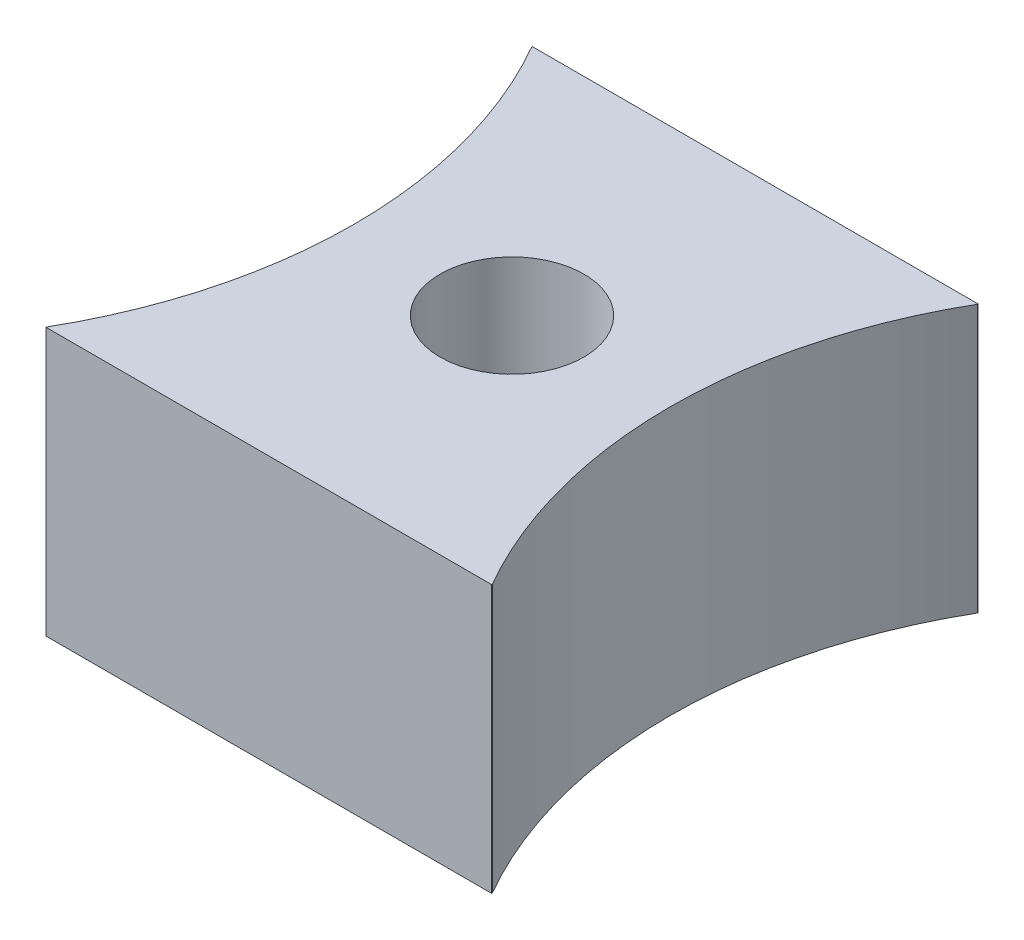
ISO-10303-21;
HEADER;
FILE_DESCRIPTION(('STEP AP214'),'2;1');
FILE_NAME('part.step','',(''),(''),'','','');
FILE_SCHEMA(('AUTOMOTIVE_DESIGN { 1 0 10303 214 1 1 1 1 }'));
ENDSEC;
DATA;
#1=APPLICATION_CONTEXT('core data for automotive mechanical design processes');
#2=APPLICATION_PROTOCOL_DEFINITION('international standard','automotive_design',2000,#1);
#3=PRODUCT_CONTEXT('',#1,'mechanical');
#4=PRODUCT('Part','Part','',(#3));
#5=PRODUCT_RELATED_PRODUCT_CATEGORY('part','',(#4));
#6=PRODUCT_DEFINITION_FORMATION('','',#4);
#7=PRODUCT_DEFINITION_CONTEXT('part definition',#1,'design');
#8=PRODUCT_DEFINITION('design','',#6,#7);
#9=PRODUCT_DEFINITION_SHAPE('','',#8);
#10=(LENGTH_UNIT() NAMED_UNIT(*) SI_UNIT(.MILLI.,.METRE.));
#11=(NAMED_UNIT(*) PLANE_ANGLE_UNIT() SI_UNIT($,.RADIAN.));
#12=(NAMED_UNIT(*) SI_UNIT($,.STERADIAN.) SOLID_ANGLE_UNIT());
#13=UNCERTAINTY_MEASURE_WITH_UNIT(LENGTH_MEASURE(1.E-05),#10,'distance_accuracy_value','');
#14=(GEOMETRIC_REPRESENTATION_CONTEXT(3) GLOBAL_UNCERTAINTY_ASSIGNED_CONTEXT((#13)) GLOBAL_UNIT_ASSIGNED_CONTEXT((#10,
#11,#12)) REPRESENTATION_CONTEXT('',''));
#15=CARTESIAN_POINT('',(0.,0.,0.));
#16=DIRECTION('',(0.,0.,1.));
#17=DIRECTION('',(1.,0.,0.));
#18=AXIS2_PLACEMENT_3D('',#15,#16,#17);
#19=CARTESIAN_POINT('',(0.,6.6,0.));
#20=DIRECTION('',(1.,0.,0.));
#21=DIRECTION('',(0.,0.,-1.));
#22=AXIS2_PLACEMENT_3D('',#19,#20,#21);
#23=PLANE('',#22);
#24=DIRECTION('',(0.,0.,1.));
#25=VECTOR('',#24,1.);
#26=CARTESIAN_POINT('',(0.,0.,0.));
#27=LINE('',#26,#25);
#28=CARTESIAN_POINT('',(0.,0.,0.));
#29=VERTEX_POINT('',#28);
#30=CARTESIAN_POINT('',(0.,0.,0.013348181161687));
#31=VERTEX_POINT('',#30);
#32=EDGE_CURVE('E140',#29,#31,#27,.T.);
#33=ORIENTED_EDGE('',*,*,#32,.T.);
#34=DIRECTION('',(0.,1.,0.));
#35=VECTOR('',#34,1.);
#36=CARTESIAN_POINT('',(0.,0.,0.013348181161687));
#37=LINE('',#36,#35);
#38=CARTESIAN_POINT('',(0.,6.6,0.013348181161687));
#39=VERTEX_POINT('',#38);
#40=EDGE_CURVE('E69',#31,#39,#37,.T.);
#41=ORIENTED_EDGE('',*,*,#40,.T.);
#42=DIRECTION('',(0.,0.,1.));
#43=VECTOR('',#42,1.);
#44=CARTESIAN_POINT('',(0.,6.6,0.));
#45=LINE('',#44,#43);
#46=CARTESIAN_POINT('',(0.,6.6,0.));
#47=VERTEX_POINT('',#46);
#48=EDGE_CURVE('E183',#47,#39,#45,.T.);
#49=ORIENTED_EDGE('',*,*,#48,.F.);
#50=DIRECTION('',(0.,-1.,0.));
#51=VECTOR('',#50,1.);
#52=CARTESIAN_POINT('',(0.,6.6,0.));
#53=LINE('',#52,#51);
#54=EDGE_CURVE('E147',#47,#29,#53,.T.);
#55=ORIENTED_EDGE('',*,*,#54,.T.);
#56=EDGE_LOOP('',(#33,#41,#49,#55));
#57=FACE_BOUND('',#56,.T.);
#58=ADVANCED_FACE('F45',(#57),#23,.F.);
#59=CARTESIAN_POINT('',(11.,6.6,0.));
#60=DIRECTION('',(-1.,0.,0.));
#61=DIRECTION('',(0.,0.,1.));
#62=AXIS2_PLACEMENT_3D('',#59,#60,#61);
#63=PLANE('',#62);
#64=DIRECTION('',(0.,1.,0.));
#65=VECTOR('',#64,1.);
#66=CARTESIAN_POINT('',(11.,0.,11.9866518188383));
#67=LINE('',#66,#65);
#68=CARTESIAN_POINT('',(11.,0.,11.9866518188383));
#69=VERTEX_POINT('',#68);
#70=CARTESIAN_POINT('',(11.,6.6,11.9866518188383));
#71=VERTEX_POINT('',#70);
#72=EDGE_CURVE('E61',#69,#71,#67,.T.);
#73=ORIENTED_EDGE('',*,*,#72,.T.);
#74=DIRECTION('',(0.,0.,-1.));
#75=VECTOR('',#74,1.);
#76=CARTESIAN_POINT('',(11.,6.6,0.));
#77=LINE('',#76,#75);
#78=CARTESIAN_POINT('',(11.,6.6,12.));
#79=VERTEX_POINT('',#78);
#80=EDGE_CURVE('E161',#79,#71,#77,.T.);
#81=ORIENTED_EDGE('',*,*,#80,.F.);
#82=DIRECTION('',(0.,-1.,0.));
#83=VECTOR('',#82,1.);
#84=CARTESIAN_POINT('',(11.,6.6,12.));
#85=LINE('',#84,#83);
#86=CARTESIAN_POINT('',(11.,0.,12.));
#87=VERTEX_POINT('',#86);
#88=EDGE_CURVE('E54',#79,#87,#85,.T.);
#89=ORIENTED_EDGE('',*,*,#88,.T.);
#90=DIRECTION('',(0.,0.,-1.));
#91=VECTOR('',#90,1.);
#92=CARTESIAN_POINT('',(11.,0.,0.));
#93=LINE('',#92,#91);
#94=EDGE_CURVE('E135',#87,#69,#93,.T.);
#95=ORIENTED_EDGE('',*,*,#94,.T.);
#96=EDGE_LOOP('',(#73,#81,#89,#95));
#97=FACE_BOUND('',#96,.T.);
#98=ADVANCED_FACE('F159',(#97),#63,.F.);
#99=DIRECTION('',(0.,1.,0.));
#100=VECTOR('',#99,1.);
#101=CARTESIAN_POINT('',(11.,0.,0.0133481811616879));
#102=LINE('',#101,#100);
#103=CARTESIAN_POINT('',(11.,0.,0.0133481811616879));
#104=VERTEX_POINT('',#103);
#105=CARTESIAN_POINT('',(11.,6.6,0.0133481811616879));
#106=VERTEX_POINT('',#105);
#107=EDGE_CURVE('E111',#104,#106,#102,.T.);
#108=ORIENTED_EDGE('',*,*,#107,.F.);
#109=CARTESIAN_POINT('',(11.,0.,0.));
#110=VERTEX_POINT('',#109);
#111=EDGE_CURVE('E124',#104,#110,#93,.T.);
#112=ORIENTED_EDGE('',*,*,#111,.T.);
#113=DIRECTION('',(0.,-1.,0.));
#114=VECTOR('',#113,1.);
#115=CARTESIAN_POINT('',(11.,6.6,0.));
#116=LINE('',#115,#114);
#117=CARTESIAN_POINT('',(11.,6.6,0.));
#118=VERTEX_POINT('',#117);
#119=EDGE_CURVE('E151',#118,#110,#116,.T.);
#120=ORIENTED_EDGE('',*,*,#119,.F.);
#121=EDGE_CURVE('E126',#106,#118,#77,.T.);
#122=ORIENTED_EDGE('',*,*,#121,.F.);
#123=EDGE_LOOP('',(#108,#112,#120,#122));
#124=FACE_BOUND('',#123,.T.);
#125=ADVANCED_FACE('F122',(#124),#63,.F.);
#126=CARTESIAN_POINT('',(0.,6.6,0.));
#127=DIRECTION('',(0.,1.,0.));
#128=DIRECTION('',(0.,0.,1.));
#129=AXIS2_PLACEMENT_3D('',#126,#127,#128);
#130=PLANE('',#129);
#131=CARTESIAN_POINT('',(5.5,6.6,6.));
#132=DIRECTION('',(0.,1.,0.));
#133=DIRECTION('',(0.,0.,1.));
#134=AXIS2_PLACEMENT_3D('',#131,#132,#133);
#135=CIRCLE('',#134,1.775);
#136=CARTESIAN_POINT('',(5.5,6.6,7.775));
#137=VERTEX_POINT('',#136);
#138=EDGE_CURVE('E187',#137,#137,#135,.T.);
#139=ORIENTED_EDGE('',*,*,#138,.F.);
#140=EDGE_LOOP('',(#139));
#141=FACE_BOUND('',#140,.T.);
#142=ORIENTED_EDGE('',*,*,#80,.T.);
#143=CARTESIAN_POINT('',(21.4,6.6,5.99999999999999));
#144=DIRECTION('',(0.,1.,0.));
#145=DIRECTION('',(0.,0.,1.));
#146=AXIS2_PLACEMENT_3D('',#143,#144,#145);
#147=CIRCLE('',#146,12.);
#148=EDGE_CURVE('E118',#71,#106,#147,.F.);
#149=ORIENTED_EDGE('',*,*,#148,.T.);
#150=ORIENTED_EDGE('',*,*,#121,.T.);
#151=DIRECTION('',(-1.,0.,0.));
#152=VECTOR('',#151,1.);
#153=CARTESIAN_POINT('',(0.,6.6,0.));
#154=LINE('',#153,#152);
#155=EDGE_CURVE('E152',#118,#47,#154,.T.);
#156=ORIENTED_EDGE('',*,*,#155,.T.);
#157=ORIENTED_EDGE('',*,*,#48,.T.);
#158=CARTESIAN_POINT('',(-10.4,6.6,6.));
#159=DIRECTION('',(0.,1.,0.));
#160=DIRECTION('',(0.,0.,1.));
#161=AXIS2_PLACEMENT_3D('',#158,#159,#160);
#162=CIRCLE('',#161,12.);
#163=CARTESIAN_POINT('',(0.,6.6,11.9866518188383));
#164=VERTEX_POINT('',#163);
#165=EDGE_CURVE('E195',#164,#39,#162,.T.);
#166=ORIENTED_EDGE('',*,*,#165,.F.);
#167=CARTESIAN_POINT('',(0.,6.6,12.));
#168=VERTEX_POINT('',#167);
#169=EDGE_CURVE('E146',#164,#168,#45,.T.);
#170=ORIENTED_EDGE('',*,*,#169,.T.);
#171=DIRECTION('',(1.,0.,0.));
#172=VECTOR('',#171,1.);
#173=CARTESIAN_POINT('',(0.,6.6,12.));
#174=LINE('',#173,#172);
#175=EDGE_CURVE('E168',#168,#79,#174,.T.);
#176=ORIENTED_EDGE('',*,*,#175,.T.);
#177=EDGE_LOOP('',(#142,#149,#150,#156,#157,#166,#170,#176));
#178=FACE_BOUND('',#177,.T.);
#179=ADVANCED_FACE('F209',(#141,#178),#130,.T.);
#180=CARTESIAN_POINT('',(0.,0.,0.));
#181=DIRECTION('',(0.,1.,0.));
#182=DIRECTION('',(0.,0.,1.));
#183=AXIS2_PLACEMENT_3D('',#180,#181,#182);
#184=PLANE('',#183);
#185=CARTESIAN_POINT('',(5.5,0.,6.));
#186=DIRECTION('',(0.,1.,0.));
#187=DIRECTION('',(0.,0.,1.));
#188=AXIS2_PLACEMENT_3D('',#185,#186,#187);
#189=CIRCLE('',#188,1.775);
#190=CARTESIAN_POINT('',(5.5,0.,7.775));
#191=VERTEX_POINT('',#190);
#192=EDGE_CURVE('E191',#191,#191,#189,.T.);
#193=ORIENTED_EDGE('',*,*,#192,.T.);
#194=EDGE_LOOP('',(#193));
#195=FACE_BOUND('',#194,.T.);
#196=CARTESIAN_POINT('',(21.4,0.,5.99999999999999));
#197=DIRECTION('',(0.,1.,0.));
#198=DIRECTION('',(0.,0.,1.));
#199=AXIS2_PLACEMENT_3D('',#196,#197,#198);
#200=CIRCLE('',#199,12.);
#201=EDGE_CURVE('E108',#69,#104,#200,.F.);
#202=ORIENTED_EDGE('',*,*,#201,.F.);
#203=ORIENTED_EDGE('',*,*,#94,.F.);
#204=DIRECTION('',(1.,0.,0.));
#205=VECTOR('',#204,1.);
#206=CARTESIAN_POINT('',(0.,0.,12.));
#207=LINE('',#206,#205);
#208=CARTESIAN_POINT('',(0.,0.,12.));
#209=VERTEX_POINT('',#208);
#210=EDGE_CURVE('E136',#209,#87,#207,.T.);
#211=ORIENTED_EDGE('',*,*,#210,.F.);
#212=CARTESIAN_POINT('',(0.,0.,11.9866518188383));
#213=VERTEX_POINT('',#212);
#214=EDGE_CURVE('E128',#213,#209,#27,.T.);
#215=ORIENTED_EDGE('',*,*,#214,.F.);
#216=CARTESIAN_POINT('',(-10.4,0.,6.));
#217=DIRECTION('',(0.,1.,0.));
#218=DIRECTION('',(0.,0.,1.));
#219=AXIS2_PLACEMENT_3D('',#216,#217,#218);
#220=CIRCLE('',#219,12.);
#221=EDGE_CURVE('E198',#213,#31,#220,.T.);
#222=ORIENTED_EDGE('',*,*,#221,.T.);
#223=ORIENTED_EDGE('',*,*,#32,.F.);
#224=DIRECTION('',(-1.,0.,0.));
#225=VECTOR('',#224,1.);
#226=CARTESIAN_POINT('',(0.,0.,0.));
#227=LINE('',#226,#225);
#228=EDGE_CURVE('E133',#110,#29,#227,.T.);
#229=ORIENTED_EDGE('',*,*,#228,.F.);
#230=ORIENTED_EDGE('',*,*,#111,.F.);
#231=EDGE_LOOP('',(#202,#203,#211,#215,#222,#223,#229,#230));
#232=FACE_BOUND('',#231,.T.);
#233=ADVANCED_FACE('F131',(#195,#232),#184,.F.);
#234=ORIENTED_EDGE('',*,*,#169,.F.);
#235=DIRECTION('',(0.,1.,0.));
#236=VECTOR('',#235,1.);
#237=CARTESIAN_POINT('',(0.,0.,11.9866518188383));
#238=LINE('',#237,#236);
#239=EDGE_CURVE('E172',#213,#164,#238,.T.);
#240=ORIENTED_EDGE('',*,*,#239,.F.);
#241=ORIENTED_EDGE('',*,*,#214,.T.);
#242=DIRECTION('',(0.,-1.,0.));
#243=VECTOR('',#242,1.);
#244=CARTESIAN_POINT('',(0.,6.6,12.));
#245=LINE('',#244,#243);
#246=EDGE_CURVE('E11',#168,#209,#245,.T.);
#247=ORIENTED_EDGE('',*,*,#246,.F.);
#248=EDGE_LOOP('',(#234,#240,#241,#247));
#249=FACE_BOUND('',#248,.T.);
#250=ADVANCED_FACE('F47',(#249),#23,.F.);
#251=CARTESIAN_POINT('',(0.,6.6,12.));
#252=DIRECTION('',(0.,0.,-1.));
#253=DIRECTION('',(-1.,0.,0.));
#254=AXIS2_PLACEMENT_3D('',#251,#252,#253);
#255=PLANE('',#254);
#256=ORIENTED_EDGE('',*,*,#210,.T.);
#257=ORIENTED_EDGE('',*,*,#88,.F.);
#258=ORIENTED_EDGE('',*,*,#175,.F.);
#259=ORIENTED_EDGE('',*,*,#246,.T.);
#260=EDGE_LOOP('',(#256,#257,#258,#259));
#261=FACE_BOUND('',#260,.T.);
#262=ADVANCED_FACE('F167',(#261),#255,.F.);
#263=CARTESIAN_POINT('',(0.,6.6,0.));
#264=DIRECTION('',(0.,0.,1.));
#265=DIRECTION('',(1.,0.,0.));
#266=AXIS2_PLACEMENT_3D('',#263,#264,#265);
#267=PLANE('',#266);
#268=ORIENTED_EDGE('',*,*,#228,.T.);
#269=ORIENTED_EDGE('',*,*,#54,.F.);
#270=ORIENTED_EDGE('',*,*,#155,.F.);
#271=ORIENTED_EDGE('',*,*,#119,.T.);
#272=EDGE_LOOP('',(#268,#269,#270,#271));
#273=FACE_BOUND('',#272,.T.);
#274=ADVANCED_FACE('F219',(#273),#267,.F.);
#275=CARTESIAN_POINT('',(5.5,0.,6.));
#276=DIRECTION('',(0.,1.,0.));
#277=DIRECTION('',(0.,0.,1.));
#278=AXIS2_PLACEMENT_3D('',#275,#276,#277);
#279=CYLINDRICAL_SURFACE('',#278,1.775);
#280=ORIENTED_EDGE('',*,*,#192,.F.);
#281=EDGE_LOOP('',(#280));
#282=FACE_BOUND('',#281,.T.);
#283=ORIENTED_EDGE('',*,*,#138,.T.);
#284=EDGE_LOOP('',(#283));
#285=FACE_BOUND('',#284,.T.);
#286=ADVANCED_FACE('F221',(#282,#285),#279,.F.);
#287=CARTESIAN_POINT('',(-10.4,0.,6.));
#288=DIRECTION('',(0.,1.,0.));
#289=DIRECTION('',(0.,0.,1.));
#290=AXIS2_PLACEMENT_3D('',#287,#288,#289);
#291=CYLINDRICAL_SURFACE('',#290,12.);
#292=ORIENTED_EDGE('',*,*,#165,.T.);
#293=ORIENTED_EDGE('',*,*,#40,.F.);
#294=ORIENTED_EDGE('',*,*,#221,.F.);
#295=ORIENTED_EDGE('',*,*,#239,.T.);
#296=EDGE_LOOP('',(#292,#293,#294,#295));
#297=FACE_BOUND('',#296,.T.);
#298=ADVANCED_FACE('F214',(#297),#291,.F.);
#299=CARTESIAN_POINT('',(21.4,0.,5.99999999999999));
#300=DIRECTION('',(0.,1.,0.));
#301=DIRECTION('',(0.,0.,1.));
#302=AXIS2_PLACEMENT_3D('',#299,#300,#301);
#303=CYLINDRICAL_SURFACE('',#302,12.);
#304=ORIENTED_EDGE('',*,*,#148,.F.);
#305=ORIENTED_EDGE('',*,*,#72,.F.);
#306=ORIENTED_EDGE('',*,*,#201,.T.);
#307=ORIENTED_EDGE('',*,*,#107,.T.);
#308=EDGE_LOOP('',(#304,#305,#306,#307));
#309=FACE_BOUND('',#308,.T.);
#310=ADVANCED_FACE('F110',(#309),#303,.F.);
#311=CLOSED_SHELL('',(#58,#98,#125,#179,#233,#250,#262,#274,#286,#298,#310));
#312=MANIFOLD_SOLID_BREP('B2',#311);
#313=ADVANCED_BREP_SHAPE_REPRESENTATION('',(#18,#312),#14);
#314=SHAPE_DEFINITION_REPRESENTATION(#9,#313);
ENDSEC;
END-ISO-10303-21;
